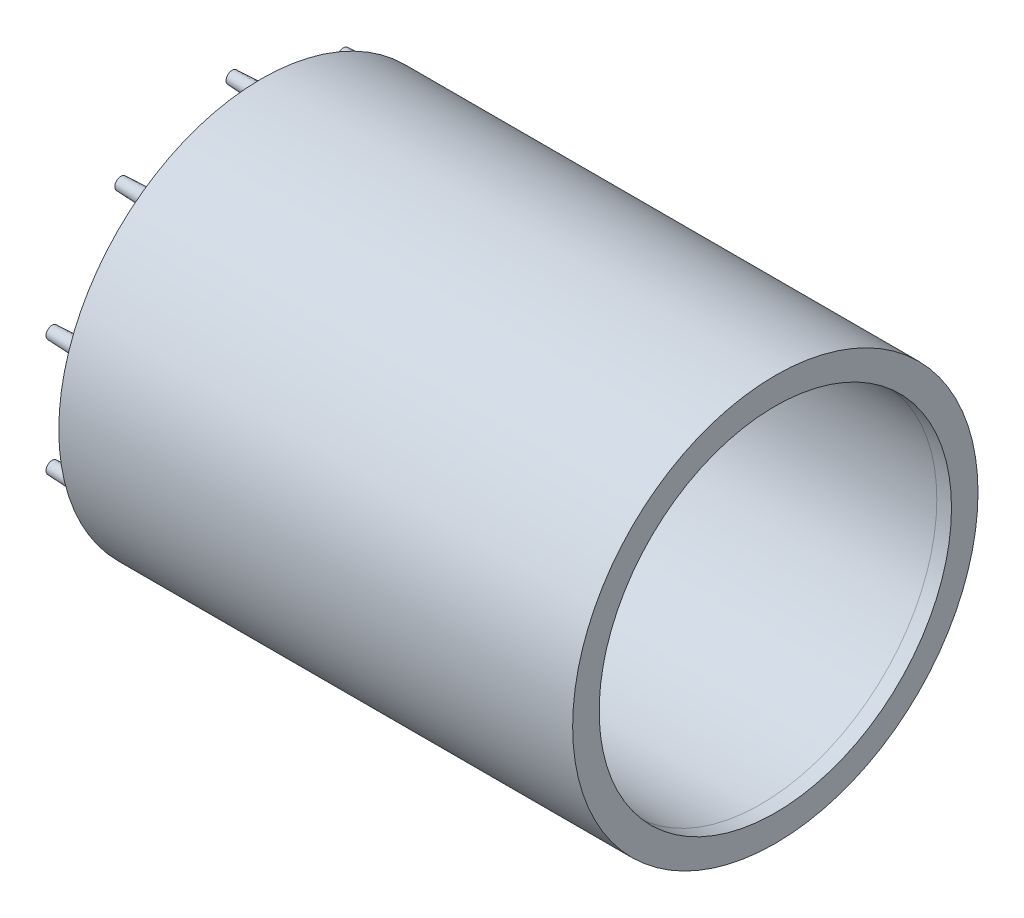
ISO-10303-21;
HEADER;
FILE_DESCRIPTION(('STEP AP214'),'2;1');
FILE_NAME('part.step','',(''),(''),'','','');
FILE_SCHEMA(('AUTOMOTIVE_DESIGN { 1 0 10303 214 1 1 1 1 }'));
ENDSEC;
DATA;
#1=APPLICATION_CONTEXT('core data for automotive mechanical design processes');
#2=APPLICATION_PROTOCOL_DEFINITION('international standard','automotive_design',2000,#1);
#3=PRODUCT_CONTEXT('',#1,'mechanical');
#4=PRODUCT('Part','Part','',(#3));
#5=PRODUCT_RELATED_PRODUCT_CATEGORY('part','',(#4));
#6=PRODUCT_DEFINITION_FORMATION('','',#4);
#7=PRODUCT_DEFINITION_CONTEXT('part definition',#1,'design');
#8=PRODUCT_DEFINITION('design','',#6,#7);
#9=PRODUCT_DEFINITION_SHAPE('','',#8);
#10=(LENGTH_UNIT() NAMED_UNIT(*) SI_UNIT(.MILLI.,.METRE.));
#11=(NAMED_UNIT(*) PLANE_ANGLE_UNIT() SI_UNIT($,.RADIAN.));
#12=(NAMED_UNIT(*) SI_UNIT($,.STERADIAN.) SOLID_ANGLE_UNIT());
#13=UNCERTAINTY_MEASURE_WITH_UNIT(LENGTH_MEASURE(1.E-05),#10,'distance_accuracy_value','');
#14=(GEOMETRIC_REPRESENTATION_CONTEXT(3) GLOBAL_UNCERTAINTY_ASSIGNED_CONTEXT((#13)) GLOBAL_UNIT_ASSIGNED_CONTEXT((#10,
#11,#12)) REPRESENTATION_CONTEXT('',''));
#15=CARTESIAN_POINT('',(0.,0.,0.));
#16=DIRECTION('',(0.,0.,1.));
#17=DIRECTION('',(1.,0.,0.));
#18=AXIS2_PLACEMENT_3D('',#15,#16,#17);
#19=CARTESIAN_POINT('',(0.,-76.2,0.));
#20=DIRECTION('',(1.,0.,0.));
#21=DIRECTION('',(0.,0.,-1.));
#22=AXIS2_PLACEMENT_3D('',#19,#20,#21);
#23=CYLINDRICAL_SURFACE('',#22,87.6605702842971);
#24=CARTESIAN_POINT('',(-215.9,-76.2,0.));
#25=DIRECTION('',(1.,0.,0.));
#26=DIRECTION('',(0.,0.,-1.));
#27=AXIS2_PLACEMENT_3D('',#24,#25,#26);
#28=CIRCLE('',#27,87.6605702842971);
#29=CARTESIAN_POINT('',(-215.9,-76.2,-87.6605702842971));
#30=VERTEX_POINT('',#29);
#31=EDGE_CURVE('E80',#30,#30,#28,.T.);
#32=ORIENTED_EDGE('',*,*,#31,.T.);
#33=EDGE_LOOP('',(#32));
#34=FACE_BOUND('',#33,.T.);
#35=CARTESIAN_POINT('',(6.35000000000027,-76.2,0.));
#36=DIRECTION('',(1.,0.,0.));
#37=DIRECTION('',(0.,0.,-1.));
#38=AXIS2_PLACEMENT_3D('',#35,#36,#37);
#39=CIRCLE('',#38,87.6605702842971);
#40=CARTESIAN_POINT('',(6.35000000000027,-76.2,-87.6605702842971));
#41=VERTEX_POINT('',#40);
#42=EDGE_CURVE('E89',#41,#41,#39,.T.);
#43=ORIENTED_EDGE('',*,*,#42,.F.);
#44=EDGE_LOOP('',(#43));
#45=FACE_BOUND('',#44,.T.);
#46=ADVANCED_FACE('F35',(#34,#45),#23,.T.);
#47=CARTESIAN_POINT('',(0.,0.,0.));
#48=CARTESIAN_POINT('',(-50.8,0.,0.));
#49=CARTESIAN_POINT('',(-101.6,0.,0.));
#50=CARTESIAN_POINT('',(-157.18237532759,0.,0.));
#51=CARTESIAN_POINT('',(-166.74712598277,0.,0.));
#52=CARTESIAN_POINT('',(-181.09425196554,0.,0.));
#53=CARTESIAN_POINT('',(-190.65900262072,0.,0.));
#54=CARTESIAN_POINT('',(-199.585120864969,0.,0.));
#55=CARTESIAN_POINT('',(-207.872606698287,0.,0.));
#56=CARTESIAN_POINT('',(-220.304800851467,-0.15495983877073,0.));
#57=CARTESIAN_POINT('',(-228.589711976257,-0.361524820706449,0.));
#58=CARTESIAN_POINT('',(-235.094659098791,-0.523710541786571,0.));
#59=CARTESIAN_POINT('',(-239.819642219067,-0.641517002011094,0.));
#60=CARTESIAN_POINT('',(-245.046645358789,-0.791480258471811,0.));
#61=CARTESIAN_POINT('',(-247.911294959409,-0.876040976098197,0.));
#62=CARTESIAN_POINT('',(-248.413737761523,-0.890953220604229,0.));
#63=B_SPLINE_CURVE_WITH_KNOTS('',3,(#47,#48,#49,#50,#51,#52,#53,#54,#55,#56,#57,#58,#59,#60,#61,
#62),.UNSPECIFIED.,.F.,.F.,(4,2,1,1,2,1,1,2,1,1,4),(0.761574076780111,0.907841521459126,
0.921611321039098,0.93538112061907,0.949150920199042,0.961081917990901,0.97301291578276,
0.98494391357462,0.991748303184292,0.998552692793965,1.),.UNSPECIFIED.);
#64=CARTESIAN_POINT('',(0.,-76.2,0.));
#65=DIRECTION('',(1.,0.,0.));
#66=AXIS1_PLACEMENT('',#64,#65);
#67=SURFACE_OF_REVOLUTION('',#63,#66);
#68=CARTESIAN_POINT('',(-215.9,-76.2,0.));
#69=DIRECTION('',(1.,0.,0.));
#70=DIRECTION('',(0.,0.,-1.));
#71=AXIS2_PLACEMENT_3D('',#68,#69,#70);
#72=CIRCLE('',#71,76.091842302558);
#73=CARTESIAN_POINT('',(-215.9,-76.2,-76.091842302558));
#74=VERTEX_POINT('',#73);
#75=EDGE_CURVE('E77',#74,#74,#72,.F.);
#76=ORIENTED_EDGE('',*,*,#75,.T.);
#77=EDGE_LOOP('',(#76));
#78=FACE_BOUND('',#77,.T.);
#79=CARTESIAN_POINT('',(0.,-76.2,0.));
#80=DIRECTION('',(1.,0.,0.));
#81=DIRECTION('',(0.,0.,-1.));
#82=AXIS2_PLACEMENT_3D('',#79,#80,#81);
#83=CIRCLE('',#82,76.2);
#84=CARTESIAN_POINT('',(0.,-76.2,-76.2));
#85=VERTEX_POINT('',#84);
#86=EDGE_CURVE('E76',#85,#85,#83,.T.);
#87=ORIENTED_EDGE('',*,*,#86,.T.);
#88=EDGE_LOOP('',(#87));
#89=FACE_BOUND('',#88,.T.);
#90=ADVANCED_FACE('F101',(#78,#89),#67,.T.);
#91=CARTESIAN_POINT('',(0.,-76.2,0.));
#92=DIRECTION('',(1.,0.,0.));
#93=DIRECTION('',(0.,0.,-1.));
#94=AXIS2_PLACEMENT_3D('',#91,#92,#93);
#95=CYLINDRICAL_SURFACE('',#94,76.2);
#96=CARTESIAN_POINT('',(6.34999999999949,-76.2,0.));
#97=DIRECTION('',(1.,0.,0.));
#98=DIRECTION('',(0.,0.,-1.));
#99=AXIS2_PLACEMENT_3D('',#96,#97,#98);
#100=CIRCLE('',#99,76.2);
#101=CARTESIAN_POINT('',(6.34999999999949,-76.2,-76.2));
#102=VERTEX_POINT('',#101);
#103=EDGE_CURVE('E85',#102,#102,#100,.T.);
#104=ORIENTED_EDGE('',*,*,#103,.T.);
#105=EDGE_LOOP('',(#104));
#106=FACE_BOUND('',#105,.T.);
#107=ORIENTED_EDGE('',*,*,#86,.F.);
#108=EDGE_LOOP('',(#107));
#109=FACE_BOUND('',#108,.T.);
#110=ADVANCED_FACE('F104',(#106,#109),#95,.F.);
#111=CARTESIAN_POINT('',(6.34999999999988,-7.78023478975536E-13,0.));
#112=DIRECTION('',(-1.,0.,0.));
#113=DIRECTION('',(0.,0.,1.));
#114=AXIS2_PLACEMENT_3D('',#111,#112,#113);
#115=PLANE('',#114);
#116=ORIENTED_EDGE('',*,*,#103,.F.);
#117=EDGE_LOOP('',(#116));
#118=FACE_BOUND('',#117,.T.);
#119=ORIENTED_EDGE('',*,*,#42,.T.);
#120=EDGE_LOOP('',(#119));
#121=FACE_BOUND('',#120,.T.);
#122=ADVANCED_FACE('F108',(#118,#121),#115,.F.);
#123=CARTESIAN_POINT('',(-215.9,0.,0.));
#124=DIRECTION('',(1.,0.,0.));
#125=DIRECTION('',(0.,0.,-1.));
#126=AXIS2_PLACEMENT_3D('',#123,#124,#125);
#127=PLANE('',#126);
#128=CARTESIAN_POINT('',(-215.9,-101.501139185765,-77.8688995437771));
#129=DIRECTION('',(1.,0.,0.));
#130=DIRECTION('',(0.,0.,-1.));
#131=AXIS2_PLACEMENT_3D('',#128,#129,#130);
#132=CIRCLE('',#131,3.175);
#133=CARTESIAN_POINT('',(-215.9,-101.501139185765,-81.0438995437771));
#134=VERTEX_POINT('',#133);
#135=EDGE_CURVE('E10',#134,#134,#132,.F.);
#136=ORIENTED_EDGE('',*,*,#135,.F.);
#137=EDGE_LOOP('',(#136));
#138=FACE_BOUND('',#137,.T.);
#139=CARTESIAN_POINT('',(-215.9,-142.439242342411,-48.1256265845978));
#140=DIRECTION('',(1.,0.,0.));
#141=DIRECTION('',(0.,0.,-1.));
#142=AXIS2_PLACEMENT_3D('',#139,#140,#141);
#143=CIRCLE('',#142,3.17499999999999);
#144=CARTESIAN_POINT('',(-215.9,-142.439242342411,-51.3006265845978));
#145=VERTEX_POINT('',#144);
#146=EDGE_CURVE('E42',#145,#145,#143,.F.);
#147=ORIENTED_EDGE('',*,*,#146,.F.);
#148=EDGE_LOOP('',(#147));
#149=FACE_BOUND('',#148,.T.);
#150=CARTESIAN_POINT('',(-215.9,-158.076206313297,1.56876128926297E-11));
#151=DIRECTION('',(1.,0.,0.));
#152=DIRECTION('',(0.,0.,-1.));
#153=AXIS2_PLACEMENT_3D('',#150,#151,#152);
#154=CIRCLE('',#153,3.175);
#155=CARTESIAN_POINT('',(-215.9,-158.076206313297,-3.17499999998431));
#156=VERTEX_POINT('',#155);
#157=EDGE_CURVE('E48',#156,#156,#154,.F.);
#158=ORIENTED_EDGE('',*,*,#157,.F.);
#159=EDGE_LOOP('',(#158));
#160=FACE_BOUND('',#159,.T.);
#161=CARTESIAN_POINT('',(-215.9,-142.439242342402,48.1256265846262));
#162=DIRECTION('',(1.,0.,0.));
#163=DIRECTION('',(0.,0.,-1.));
#164=AXIS2_PLACEMENT_3D('',#161,#162,#163);
#165=CIRCLE('',#164,3.175);
#166=CARTESIAN_POINT('',(-215.9,-142.439242342402,44.9506265846262));
#167=VERTEX_POINT('',#166);
#168=EDGE_CURVE('E52',#167,#167,#165,.F.);
#169=ORIENTED_EDGE('',*,*,#168,.F.);
#170=EDGE_LOOP('',(#169));
#171=FACE_BOUND('',#170,.T.);
#172=CARTESIAN_POINT('',(-215.9,-101.501139185751,77.8688995437981));
#173=DIRECTION('',(1.,0.,0.));
#174=DIRECTION('',(0.,0.,-1.));
#175=AXIS2_PLACEMENT_3D('',#172,#173,#174);
#176=CIRCLE('',#175,3.17499999999999);
#177=CARTESIAN_POINT('',(-215.9,-101.501139185751,74.6938995437981));
#178=VERTEX_POINT('',#177);
#179=EDGE_CURVE('E57',#178,#178,#176,.F.);
#180=ORIENTED_EDGE('',*,*,#179,.F.);
#181=EDGE_LOOP('',(#180));
#182=FACE_BOUND('',#181,.T.);
#183=CARTESIAN_POINT('',(-215.9,-50.8988608142344,77.8688995437933));
#184=DIRECTION('',(1.,0.,0.));
#185=DIRECTION('',(0.,0.,-1.));
#186=AXIS2_PLACEMENT_3D('',#183,#184,#185);
#187=CIRCLE('',#186,3.17499999999999);
#188=CARTESIAN_POINT('',(-215.9,-50.8988608142344,74.6938995437933));
#189=VERTEX_POINT('',#188);
#190=EDGE_CURVE('E61',#189,#189,#187,.F.);
#191=ORIENTED_EDGE('',*,*,#190,.F.);
#192=EDGE_LOOP('',(#191));
#193=FACE_BOUND('',#192,.T.);
#194=CARTESIAN_POINT('',(-215.9,-9.96075765758863,48.1256265846135));
#195=DIRECTION('',(1.,0.,0.));
#196=DIRECTION('',(0.,0.,-1.));
#197=AXIS2_PLACEMENT_3D('',#194,#195,#196);
#198=CIRCLE('',#197,3.175);
#199=CARTESIAN_POINT('',(-215.9,-9.96075765758863,44.9506265846136));
#200=VERTEX_POINT('',#199);
#201=EDGE_CURVE('E64',#200,#200,#198,.F.);
#202=ORIENTED_EDGE('',*,*,#201,.F.);
#203=EDGE_LOOP('',(#202));
#204=FACE_BOUND('',#203,.T.);
#205=CARTESIAN_POINT('',(-215.9,5.67620631329702,0.));
#206=DIRECTION('',(1.,0.,0.));
#207=DIRECTION('',(0.,0.,-1.));
#208=AXIS2_PLACEMENT_3D('',#205,#206,#207);
#209=CIRCLE('',#208,3.175);
#210=CARTESIAN_POINT('',(-215.9,5.67620631329702,-3.175));
#211=VERTEX_POINT('',#210);
#212=EDGE_CURVE('E67',#211,#211,#209,.F.);
#213=ORIENTED_EDGE('',*,*,#212,.F.);
#214=EDGE_LOOP('',(#213));
#215=FACE_BOUND('',#214,.T.);
#216=CARTESIAN_POINT('',(-215.9,-9.96075765759751,-48.1256265846095));
#217=DIRECTION('',(1.,0.,0.));
#218=DIRECTION('',(0.,0.,-1.));
#219=AXIS2_PLACEMENT_3D('',#216,#217,#218);
#220=CIRCLE('',#219,3.175);
#221=CARTESIAN_POINT('',(-215.9,-9.96075765759751,-51.3006265846095));
#222=VERTEX_POINT('',#221);
#223=EDGE_CURVE('E70',#222,#222,#220,.F.);
#224=ORIENTED_EDGE('',*,*,#223,.F.);
#225=EDGE_LOOP('',(#224));
#226=FACE_BOUND('',#225,.T.);
#227=CARTESIAN_POINT('',(-215.9,-50.8988608142487,-77.8688995437817));
#228=DIRECTION('',(1.,0.,0.));
#229=DIRECTION('',(0.,0.,-1.));
#230=AXIS2_PLACEMENT_3D('',#227,#228,#229);
#231=CIRCLE('',#230,3.175);
#232=CARTESIAN_POINT('',(-215.9,-50.8988608142487,-81.0438995437816));
#233=VERTEX_POINT('',#232);
#234=EDGE_CURVE('E73',#233,#233,#231,.F.);
#235=ORIENTED_EDGE('',*,*,#234,.F.);
#236=EDGE_LOOP('',(#235));
#237=FACE_BOUND('',#236,.T.);
#238=ORIENTED_EDGE('',*,*,#75,.F.);
#239=EDGE_LOOP('',(#238));
#240=FACE_BOUND('',#239,.T.);
#241=ORIENTED_EDGE('',*,*,#31,.F.);
#242=EDGE_LOOP('',(#241));
#243=FACE_BOUND('',#242,.T.);
#244=ADVANCED_FACE('F112',(#138,#149,#160,#171,#182,#193,#204,#215,#226,#237,#240,#243),#127,.F.);
#245=CARTESIAN_POINT('',(-215.9,-50.8988608142487,-77.8688995437817));
#246=DIRECTION('',(1.,0.,0.));
#247=DIRECTION('',(0.,0.,1.));
#248=AXIS2_PLACEMENT_3D('',#245,#246,#247);
#249=CONICAL_SURFACE('',#248,3.175,0.0436332312998583);
#250=CARTESIAN_POINT('',(-228.6,-50.8988608142487,-77.8688995437817));
#251=DIRECTION('',(-1.,0.,0.));
#252=DIRECTION('',(0.,0.,1.));
#253=AXIS2_PLACEMENT_3D('',#250,#251,#252);
#254=CIRCLE('',#253,2.6205060250619);
#255=CARTESIAN_POINT('',(-228.6,-50.8988608142487,-75.2483935187198));
#256=VERTEX_POINT('',#255);
#257=EDGE_CURVE('E81',#256,#256,#254,.T.);
#258=ORIENTED_EDGE('',*,*,#257,.F.);
#259=EDGE_LOOP('',(#258));
#260=FACE_BOUND('',#259,.T.);
#261=ORIENTED_EDGE('',*,*,#234,.T.);
#262=EDGE_LOOP('',(#261));
#263=FACE_BOUND('',#262,.T.);
#264=ADVANCED_FACE('F116',(#260,#263),#249,.T.);
#265=CARTESIAN_POINT('',(-228.6,0.,0.));
#266=DIRECTION('',(-1.,0.,0.));
#267=DIRECTION('',(0.,0.,1.));
#268=AXIS2_PLACEMENT_3D('',#265,#266,#267);
#269=PLANE('',#268);
#270=ORIENTED_EDGE('',*,*,#257,.T.);
#271=EDGE_LOOP('',(#270));
#272=FACE_BOUND('',#271,.T.);
#273=ADVANCED_FACE('F120',(#272),#269,.T.);
#274=CARTESIAN_POINT('',(-215.9,-9.96075765759751,-48.1256265846095));
#275=DIRECTION('',(1.,0.,0.));
#276=DIRECTION('',(0.,0.,1.));
#277=AXIS2_PLACEMENT_3D('',#274,#275,#276);
#278=CONICAL_SURFACE('',#277,3.175,0.0436332312998583);
#279=CARTESIAN_POINT('',(-228.6,-9.96075765759751,-48.1256265846095));
#280=DIRECTION('',(-1.,0.,0.));
#281=DIRECTION('',(0.,0.,1.));
#282=AXIS2_PLACEMENT_3D('',#279,#280,#281);
#283=CIRCLE('',#282,2.6205060250619);
#284=CARTESIAN_POINT('',(-228.6,-9.96075765759751,-45.5051205595476));
#285=VERTEX_POINT('',#284);
#286=EDGE_CURVE('E387',#285,#285,#283,.T.);
#287=ORIENTED_EDGE('',*,*,#286,.F.);
#288=EDGE_LOOP('',(#287));
#289=FACE_BOUND('',#288,.T.);
#290=ORIENTED_EDGE('',*,*,#223,.T.);
#291=EDGE_LOOP('',(#290));
#292=FACE_BOUND('',#291,.T.);
#293=ADVANCED_FACE('F124',(#289,#292),#278,.T.);
#294=CARTESIAN_POINT('',(-228.6,0.,0.));
#295=DIRECTION('',(-1.,0.,0.));
#296=DIRECTION('',(0.,0.,1.));
#297=AXIS2_PLACEMENT_3D('',#294,#295,#296);
#298=PLANE('',#297);
#299=ORIENTED_EDGE('',*,*,#286,.T.);
#300=EDGE_LOOP('',(#299));
#301=FACE_BOUND('',#300,.T.);
#302=ADVANCED_FACE('F128',(#301),#298,.T.);
#303=CARTESIAN_POINT('',(-215.9,5.67620631329702,0.));
#304=DIRECTION('',(1.,0.,0.));
#305=DIRECTION('',(0.,0.,1.));
#306=AXIS2_PLACEMENT_3D('',#303,#304,#305);
#307=CONICAL_SURFACE('',#306,3.175,0.0436332312998583);
#308=CARTESIAN_POINT('',(-228.6,5.67620631329702,0.));
#309=DIRECTION('',(-1.,0.,0.));
#310=DIRECTION('',(0.,0.,1.));
#311=AXIS2_PLACEMENT_3D('',#308,#309,#310);
#312=CIRCLE('',#311,2.6205060250619);
#313=CARTESIAN_POINT('',(-228.6,5.67620631329702,2.6205060250619));
#314=VERTEX_POINT('',#313);
#315=EDGE_CURVE('E384',#314,#314,#312,.T.);
#316=ORIENTED_EDGE('',*,*,#315,.F.);
#317=EDGE_LOOP('',(#316));
#318=FACE_BOUND('',#317,.T.);
#319=ORIENTED_EDGE('',*,*,#212,.T.);
#320=EDGE_LOOP('',(#319));
#321=FACE_BOUND('',#320,.T.);
#322=ADVANCED_FACE('F132',(#318,#321),#307,.T.);
#323=CARTESIAN_POINT('',(-228.6,0.,0.));
#324=DIRECTION('',(-1.,0.,0.));
#325=DIRECTION('',(0.,0.,1.));
#326=AXIS2_PLACEMENT_3D('',#323,#324,#325);
#327=PLANE('',#326);
#328=ORIENTED_EDGE('',*,*,#315,.T.);
#329=EDGE_LOOP('',(#328));
#330=FACE_BOUND('',#329,.T.);
#331=ADVANCED_FACE('F136',(#330),#327,.T.);
#332=CARTESIAN_POINT('',(-215.9,-9.96075765758863,48.1256265846135));
#333=DIRECTION('',(1.,0.,0.));
#334=DIRECTION('',(0.,0.,1.));
#335=AXIS2_PLACEMENT_3D('',#332,#333,#334);
#336=CONICAL_SURFACE('',#335,3.175,0.0436332312998583);
#337=CARTESIAN_POINT('',(-228.6,-9.96075765758863,48.1256265846135));
#338=DIRECTION('',(-1.,0.,0.));
#339=DIRECTION('',(0.,0.,1.));
#340=AXIS2_PLACEMENT_3D('',#337,#338,#339);
#341=CIRCLE('',#340,2.6205060250619);
#342=CARTESIAN_POINT('',(-228.6,-9.96075765758863,50.7461326096754));
#343=VERTEX_POINT('',#342);
#344=EDGE_CURVE('E381',#343,#343,#341,.T.);
#345=ORIENTED_EDGE('',*,*,#344,.F.);
#346=EDGE_LOOP('',(#345));
#347=FACE_BOUND('',#346,.T.);
#348=ORIENTED_EDGE('',*,*,#201,.T.);
#349=EDGE_LOOP('',(#348));
#350=FACE_BOUND('',#349,.T.);
#351=ADVANCED_FACE('F140',(#347,#350),#336,.T.);
#352=CARTESIAN_POINT('',(-228.6,0.,0.));
#353=DIRECTION('',(-1.,0.,0.));
#354=DIRECTION('',(0.,0.,1.));
#355=AXIS2_PLACEMENT_3D('',#352,#353,#354);
#356=PLANE('',#355);
#357=ORIENTED_EDGE('',*,*,#344,.T.);
#358=EDGE_LOOP('',(#357));
#359=FACE_BOUND('',#358,.T.);
#360=ADVANCED_FACE('F144',(#359),#356,.T.);
#361=CARTESIAN_POINT('',(-215.9,-50.8988608142344,77.8688995437933));
#362=DIRECTION('',(1.,0.,0.));
#363=DIRECTION('',(0.,0.,1.));
#364=AXIS2_PLACEMENT_3D('',#361,#362,#363);
#365=CONICAL_SURFACE('',#364,3.175,0.0436332312998583);
#366=CARTESIAN_POINT('',(-228.6,-50.8988608142344,77.8688995437933));
#367=DIRECTION('',(-1.,0.,0.));
#368=DIRECTION('',(0.,0.,1.));
#369=AXIS2_PLACEMENT_3D('',#366,#367,#368);
#370=CIRCLE('',#369,2.62050602506189);
#371=CARTESIAN_POINT('',(-228.6,-50.8988608142344,80.4894055688552));
#372=VERTEX_POINT('',#371);
#373=EDGE_CURVE('E378',#372,#372,#370,.T.);
#374=ORIENTED_EDGE('',*,*,#373,.F.);
#375=EDGE_LOOP('',(#374));
#376=FACE_BOUND('',#375,.T.);
#377=ORIENTED_EDGE('',*,*,#190,.T.);
#378=EDGE_LOOP('',(#377));
#379=FACE_BOUND('',#378,.T.);
#380=ADVANCED_FACE('F148',(#376,#379),#365,.T.);
#381=CARTESIAN_POINT('',(-228.6,0.,0.));
#382=DIRECTION('',(-1.,0.,0.));
#383=DIRECTION('',(0.,0.,1.));
#384=AXIS2_PLACEMENT_3D('',#381,#382,#383);
#385=PLANE('',#384);
#386=ORIENTED_EDGE('',*,*,#373,.T.);
#387=EDGE_LOOP('',(#386));
#388=FACE_BOUND('',#387,.T.);
#389=ADVANCED_FACE('F152',(#388),#385,.T.);
#390=CARTESIAN_POINT('',(-215.9,-101.501139185751,77.8688995437981));
#391=DIRECTION('',(1.,0.,0.));
#392=DIRECTION('',(0.,0.,1.));
#393=AXIS2_PLACEMENT_3D('',#390,#391,#392);
#394=CONICAL_SURFACE('',#393,3.17499999999999,0.0436332312998583);
#395=CARTESIAN_POINT('',(-228.6,-101.501139185751,77.8688995437981));
#396=DIRECTION('',(-1.,0.,0.));
#397=DIRECTION('',(0.,0.,1.));
#398=AXIS2_PLACEMENT_3D('',#395,#396,#397);
#399=CIRCLE('',#398,2.62050602506189);
#400=CARTESIAN_POINT('',(-228.6,-101.501139185751,80.48940556886));
#401=VERTEX_POINT('',#400);
#402=EDGE_CURVE('E374',#401,#401,#399,.T.);
#403=ORIENTED_EDGE('',*,*,#402,.F.);
#404=EDGE_LOOP('',(#403));
#405=FACE_BOUND('',#404,.T.);
#406=ORIENTED_EDGE('',*,*,#179,.T.);
#407=EDGE_LOOP('',(#406));
#408=FACE_BOUND('',#407,.T.);
#409=ADVANCED_FACE('F156',(#405,#408),#394,.T.);
#410=CARTESIAN_POINT('',(-228.6,0.,0.));
#411=DIRECTION('',(-1.,0.,0.));
#412=DIRECTION('',(0.,0.,1.));
#413=AXIS2_PLACEMENT_3D('',#410,#411,#412);
#414=PLANE('',#413);
#415=ORIENTED_EDGE('',*,*,#402,.T.);
#416=EDGE_LOOP('',(#415));
#417=FACE_BOUND('',#416,.T.);
#418=ADVANCED_FACE('F160',(#417),#414,.T.);
#419=CARTESIAN_POINT('',(-215.9,-142.439242342402,48.1256265846262));
#420=DIRECTION('',(1.,0.,0.));
#421=DIRECTION('',(0.,0.,1.));
#422=AXIS2_PLACEMENT_3D('',#419,#420,#421);
#423=CONICAL_SURFACE('',#422,3.175,0.0436332312998583);
#424=CARTESIAN_POINT('',(-228.6,-142.439242342402,48.1256265846262));
#425=DIRECTION('',(-1.,0.,0.));
#426=DIRECTION('',(0.,0.,1.));
#427=AXIS2_PLACEMENT_3D('',#424,#425,#426);
#428=CIRCLE('',#427,2.6205060250619);
#429=CARTESIAN_POINT('',(-228.6,-142.439242342402,50.7461326096881));
#430=VERTEX_POINT('',#429);
#431=EDGE_CURVE('E371',#430,#430,#428,.T.);
#432=ORIENTED_EDGE('',*,*,#431,.F.);
#433=EDGE_LOOP('',(#432));
#434=FACE_BOUND('',#433,.T.);
#435=ORIENTED_EDGE('',*,*,#168,.T.);
#436=EDGE_LOOP('',(#435));
#437=FACE_BOUND('',#436,.T.);
#438=ADVANCED_FACE('F164',(#434,#437),#423,.T.);
#439=CARTESIAN_POINT('',(-228.6,0.,0.));
#440=DIRECTION('',(-1.,0.,0.));
#441=DIRECTION('',(0.,0.,1.));
#442=AXIS2_PLACEMENT_3D('',#439,#440,#441);
#443=PLANE('',#442);
#444=ORIENTED_EDGE('',*,*,#431,.T.);
#445=EDGE_LOOP('',(#444));
#446=FACE_BOUND('',#445,.T.);
#447=ADVANCED_FACE('F168',(#446),#443,.T.);
#448=CARTESIAN_POINT('',(-215.9,-158.076206313297,1.56876128926297E-11));
#449=DIRECTION('',(1.,0.,0.));
#450=DIRECTION('',(0.,0.,1.));
#451=AXIS2_PLACEMENT_3D('',#448,#449,#450);
#452=CONICAL_SURFACE('',#451,3.175,0.0436332312998583);
#453=CARTESIAN_POINT('',(-228.6,-158.076206313297,1.56876128926297E-11));
#454=DIRECTION('',(-1.,0.,0.));
#455=DIRECTION('',(0.,0.,1.));
#456=AXIS2_PLACEMENT_3D('',#453,#454,#455);
#457=CIRCLE('',#456,2.62050602506189);
#458=CARTESIAN_POINT('',(-228.6,-158.076206313297,2.62050602507758));
#459=VERTEX_POINT('',#458);
#460=EDGE_CURVE('E366',#459,#459,#457,.T.);
#461=ORIENTED_EDGE('',*,*,#460,.F.);
#462=EDGE_LOOP('',(#461));
#463=FACE_BOUND('',#462,.T.);
#464=ORIENTED_EDGE('',*,*,#157,.T.);
#465=EDGE_LOOP('',(#464));
#466=FACE_BOUND('',#465,.T.);
#467=ADVANCED_FACE('F172',(#463,#466),#452,.T.);
#468=CARTESIAN_POINT('',(-228.6,0.,0.));
#469=DIRECTION('',(-1.,0.,0.));
#470=DIRECTION('',(0.,0.,1.));
#471=AXIS2_PLACEMENT_3D('',#468,#469,#470);
#472=PLANE('',#471);
#473=ORIENTED_EDGE('',*,*,#460,.T.);
#474=EDGE_LOOP('',(#473));
#475=FACE_BOUND('',#474,.T.);
#476=ADVANCED_FACE('F176',(#475),#472,.T.);
#477=CARTESIAN_POINT('',(-215.9,-142.439242342411,-48.1256265845978));
#478=DIRECTION('',(1.,0.,0.));
#479=DIRECTION('',(0.,0.,1.));
#480=AXIS2_PLACEMENT_3D('',#477,#478,#479);
#481=CONICAL_SURFACE('',#480,3.17499999999999,0.0436332312998583);
#482=CARTESIAN_POINT('',(-228.6,-142.439242342411,-48.1256265845978));
#483=DIRECTION('',(-1.,0.,0.));
#484=DIRECTION('',(0.,0.,1.));
#485=AXIS2_PLACEMENT_3D('',#482,#483,#484);
#486=CIRCLE('',#485,2.62050602506189);
#487=CARTESIAN_POINT('',(-228.6,-142.439242342411,-45.5051205595359));
#488=VERTEX_POINT('',#487);
#489=EDGE_CURVE('E363',#488,#488,#486,.T.);
#490=ORIENTED_EDGE('',*,*,#489,.F.);
#491=EDGE_LOOP('',(#490));
#492=FACE_BOUND('',#491,.T.);
#493=ORIENTED_EDGE('',*,*,#146,.T.);
#494=EDGE_LOOP('',(#493));
#495=FACE_BOUND('',#494,.T.);
#496=ADVANCED_FACE('F180',(#492,#495),#481,.T.);
#497=CARTESIAN_POINT('',(-228.6,0.,0.));
#498=DIRECTION('',(-1.,0.,0.));
#499=DIRECTION('',(0.,0.,1.));
#500=AXIS2_PLACEMENT_3D('',#497,#498,#499);
#501=PLANE('',#500);
#502=ORIENTED_EDGE('',*,*,#489,.T.);
#503=EDGE_LOOP('',(#502));
#504=FACE_BOUND('',#503,.T.);
#505=ADVANCED_FACE('F184',(#504),#501,.T.);
#506=CARTESIAN_POINT('',(-215.9,-101.501139185765,-77.8688995437771));
#507=DIRECTION('',(1.,0.,0.));
#508=DIRECTION('',(0.,0.,1.));
#509=AXIS2_PLACEMENT_3D('',#506,#507,#508);
#510=CONICAL_SURFACE('',#509,3.175,0.0436332312998583);
#511=CARTESIAN_POINT('',(-228.6,-101.501139185765,-77.8688995437771));
#512=DIRECTION('',(-1.,0.,0.));
#513=DIRECTION('',(0.,0.,1.));
#514=AXIS2_PLACEMENT_3D('',#511,#512,#513);
#515=CIRCLE('',#514,2.6205060250619);
#516=CARTESIAN_POINT('',(-228.6,-101.501139185765,-75.2483935187152));
#517=VERTEX_POINT('',#516);
#518=EDGE_CURVE('E362',#517,#517,#515,.T.);
#519=ORIENTED_EDGE('',*,*,#518,.F.);
#520=EDGE_LOOP('',(#519));
#521=FACE_BOUND('',#520,.T.);
#522=ORIENTED_EDGE('',*,*,#135,.T.);
#523=EDGE_LOOP('',(#522));
#524=FACE_BOUND('',#523,.T.);
#525=ADVANCED_FACE('F188',(#521,#524),#510,.T.);
#526=CARTESIAN_POINT('',(-228.6,0.,0.));
#527=DIRECTION('',(-1.,0.,0.));
#528=DIRECTION('',(0.,0.,1.));
#529=AXIS2_PLACEMENT_3D('',#526,#527,#528);
#530=PLANE('',#529);
#531=ORIENTED_EDGE('',*,*,#518,.T.);
#532=EDGE_LOOP('',(#531));
#533=FACE_BOUND('',#532,.T.);
#534=ADVANCED_FACE('F192',(#533),#530,.T.);
#535=CLOSED_SHELL('',(#46,#90,#110,#122,#244,#264,#273,#293,#302,#322,#331,#351,#360,#380,#389,
#409,#418,#438,#447,#467,#476,#496,#505,#525,#534));
#536=MANIFOLD_SOLID_BREP('B2',#535);
#537=ADVANCED_BREP_SHAPE_REPRESENTATION('',(#18,#536),#14);
#538=SHAPE_DEFINITION_REPRESENTATION(#9,#537);
ENDSEC;
END-ISO-10303-21;
